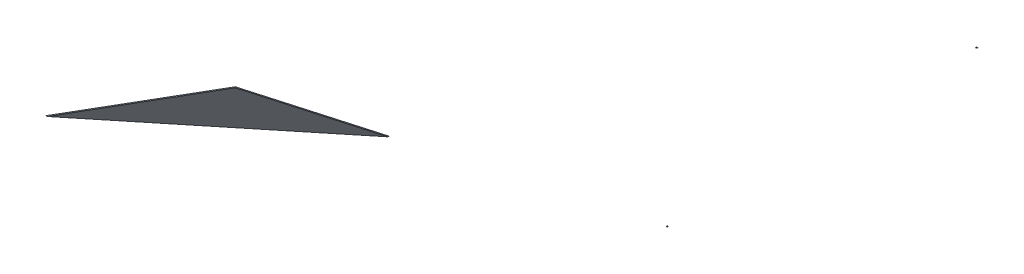
ISO-10303-21;
HEADER;
FILE_DESCRIPTION(('STEP AP214'),'2;1');
FILE_NAME('part.step','',(''),(''),'','','');
FILE_SCHEMA(('AUTOMOTIVE_DESIGN { 1 0 10303 214 1 1 1 1 }'));
ENDSEC;
DATA;
#1=APPLICATION_CONTEXT('core data for automotive mechanical design processes');
#2=APPLICATION_PROTOCOL_DEFINITION('international standard','automotive_design',2000,#1);
#3=PRODUCT_CONTEXT('',#1,'mechanical');
#4=PRODUCT('Part','Part','',(#3));
#5=PRODUCT_RELATED_PRODUCT_CATEGORY('part','',(#4));
#6=PRODUCT_DEFINITION_FORMATION('','',#4);
#7=PRODUCT_DEFINITION_CONTEXT('part definition',#1,'design');
#8=PRODUCT_DEFINITION('design','',#6,#7);
#9=PRODUCT_DEFINITION_SHAPE('','',#8);
#10=(LENGTH_UNIT() NAMED_UNIT(*) SI_UNIT(.MILLI.,.METRE.));
#11=(NAMED_UNIT(*) PLANE_ANGLE_UNIT() SI_UNIT($,.RADIAN.));
#12=(NAMED_UNIT(*) SI_UNIT($,.STERADIAN.) SOLID_ANGLE_UNIT());
#13=UNCERTAINTY_MEASURE_WITH_UNIT(LENGTH_MEASURE(1.E-05),#10,'distance_accuracy_value','');
#14=(GEOMETRIC_REPRESENTATION_CONTEXT(3) GLOBAL_UNCERTAINTY_ASSIGNED_CONTEXT((#13)) GLOBAL_UNIT_ASSIGNED_CONTEXT((#10,
#11,#12)) REPRESENTATION_CONTEXT('',''));
#15=CARTESIAN_POINT('',(0.,0.,0.));
#16=DIRECTION('',(0.,0.,1.));
#17=DIRECTION('',(1.,0.,0.));
#18=AXIS2_PLACEMENT_3D('',#15,#16,#17);
#19=CARTESIAN_POINT('',(1158.95080176923,2608.91710603682,1121.2545563695));
#20=DIRECTION('',(0.,-1.,0.));
#21=DIRECTION('',(0.,0.,-1.));
#22=AXIS2_PLACEMENT_3D('',#19,#20,#21);
#23=PLANE('',#22);
#24=DIRECTION('',(-1.,0.,0.));
#25=VECTOR('',#24,1.);
#26=CARTESIAN_POINT('',(1158.95080176923,2608.91710603682,1121.2545563695));
#27=LINE('',#26,#25);
#28=CARTESIAN_POINT('',(1158.95080176923,2608.91710603682,1121.2545563695));
#29=VERTEX_POINT('',#28);
#30=CARTESIAN_POINT('',(1155.77580176923,2608.91710603682,1121.2545563695));
#31=VERTEX_POINT('',#30);
#32=EDGE_CURVE('E77',#29,#31,#27,.T.);
#33=ORIENTED_EDGE('',*,*,#32,.T.);
#34=DIRECTION('',(0.,0.,1.));
#35=VECTOR('',#34,1.);
#36=CARTESIAN_POINT('',(1155.77580176923,2608.91710603682,1121.2545563695));
#37=LINE('',#36,#35);
#38=CARTESIAN_POINT('',(1155.77580176923,2608.91710603682,1123.8342438695));
#39=VERTEX_POINT('',#38);
#40=EDGE_CURVE('E71',#31,#39,#37,.T.);
#41=ORIENTED_EDGE('',*,*,#40,.T.);
#42=DIRECTION('',(-0.776114000116266,0.,0.630592625094465));
#43=VECTOR('',#42,1.);
#44=CARTESIAN_POINT('',(1158.95080176923,2608.91710603682,1121.2545563695));
#45=LINE('',#44,#43);
#46=EDGE_CURVE('E76',#29,#39,#45,.T.);
#47=ORIENTED_EDGE('',*,*,#46,.F.);
#48=EDGE_LOOP('',(#33,#41,#47));
#49=FACE_BOUND('',#48,.T.);
#50=ADVANCED_FACE('F48',(#49),#23,.F.);
#51=CARTESIAN_POINT('',(-316.337763001159,500.225965029596,-389.338785232194));
#52=DIRECTION('',(-0.446530337817959,0.70609992000595,-0.54957580039133));
#53=DIRECTION('',(0.,0.614210049001455,0.789142582620929));
#54=AXIS2_PLACEMENT_3D('',#51,#52,#53);
#55=PLANE('',#54);
#56=ORIENTED_EDGE('',*,*,#46,.T.);
#57=DIRECTION('',(0.,-0.614210049001455,-0.789142582620929));
#58=VECTOR('',#57,1.);
#59=CARTESIAN_POINT('',(1155.77580176923,1079.97105689285,-840.569360192474));
#60=LINE('',#59,#58);
#61=CARTESIAN_POINT('',(1155.77580176923,2606.90926864383,1121.2545563695));
#62=VERTEX_POINT('',#61);
#63=EDGE_CURVE('E64',#39,#62,#60,.T.);
#64=ORIENTED_EDGE('',*,*,#63,.T.);
#65=DIRECTION('',(0.84517937784663,0.53448275862069,0.));
#66=VECTOR('',#65,1.);
#67=CARTESIAN_POINT('',(-86.1674576744258,1821.51710603682,1121.2545563695));
#68=LINE('',#67,#66);
#69=EDGE_CURVE('E58',#62,#29,#68,.T.);
#70=ORIENTED_EDGE('',*,*,#69,.T.);
#71=EDGE_LOOP('',(#56,#64,#70));
#72=FACE_BOUND('',#71,.T.);
#73=ADVANCED_FACE('F94',(#72),#55,.F.);
#74=CARTESIAN_POINT('',(-86.1674576744258,1821.51710603682,1121.2545563695));
#75=DIRECTION('',(0.,0.,1.));
#76=DIRECTION('',(0.,-1.,0.));
#77=AXIS2_PLACEMENT_3D('',#74,#75,#76);
#78=PLANE('',#77);
#79=ORIENTED_EDGE('',*,*,#69,.F.);
#80=DIRECTION('',(0.,1.,0.));
#81=VECTOR('',#80,1.);
#82=CARTESIAN_POINT('',(1155.77580176923,1821.51710603682,1121.2545563695));
#83=LINE('',#82,#81);
#84=EDGE_CURVE('E13',#62,#31,#83,.T.);
#85=ORIENTED_EDGE('',*,*,#84,.T.);
#86=ORIENTED_EDGE('',*,*,#32,.F.);
#87=EDGE_LOOP('',(#79,#85,#86));
#88=FACE_BOUND('',#87,.T.);
#89=ADVANCED_FACE('F82',(#88),#78,.F.);
#90=CARTESIAN_POINT('',(1155.77580176923,0.,0.));
#91=DIRECTION('',(1.,0.,0.));
#92=DIRECTION('',(0.,0.,-1.));
#93=AXIS2_PLACEMENT_3D('',#90,#91,#92);
#94=PLANE('',#93);
#95=ORIENTED_EDGE('',*,*,#40,.F.);
#96=ORIENTED_EDGE('',*,*,#84,.F.);
#97=ORIENTED_EDGE('',*,*,#63,.F.);
#98=EDGE_LOOP('',(#95,#96,#97));
#99=FACE_BOUND('',#98,.T.);
#100=ADVANCED_FACE('F50',(#99),#94,.F.);
#101=CLOSED_SHELL('',(#50,#73,#89,#100));
#102=MANIFOLD_SOLID_BREP('B2',#101);
#103=CARTESIAN_POINT('',(-86.1674576744258,1821.51710603682,1781.65455636951));
#104=DIRECTION('',(0.,0.,1.));
#105=DIRECTION('',(0.,-1.,0.));
#106=AXIS2_PLACEMENT_3D('',#103,#104,#105);
#107=PLANE('',#106);
#108=DIRECTION('',(0.,1.,0.));
#109=VECTOR('',#108,1.);
#110=CARTESIAN_POINT('',(1155.77580176923,1821.51710603682,1781.65455636951));
#111=LINE('',#110,#109);
#112=CARTESIAN_POINT('',(1155.77580176923,2606.90926864383,1781.6545563695));
#113=VERTEX_POINT('',#112);
#114=CARTESIAN_POINT('',(1155.77580176923,2608.91710603682,1781.6545563695));
#115=VERTEX_POINT('',#114);
#116=EDGE_CURVE('E46',#113,#115,#111,.T.);
#117=ORIENTED_EDGE('',*,*,#116,.F.);
#118=DIRECTION('',(0.84517937784663,0.53448275862069,0.));
#119=VECTOR('',#118,1.);
#120=CARTESIAN_POINT('',(-86.1674576744258,1821.51710603682,1781.65455636951));
#121=LINE('',#120,#119);
#122=CARTESIAN_POINT('',(1158.95080176923,2608.91710603682,1781.6545563695));
#123=VERTEX_POINT('',#122);
#124=EDGE_CURVE('E173',#113,#123,#121,.T.);
#125=ORIENTED_EDGE('',*,*,#124,.T.);
#126=DIRECTION('',(-1.,0.,0.));
#127=VECTOR('',#126,1.);
#128=CARTESIAN_POINT('',(1158.95080176923,2608.91710603682,1781.6545563695));
#129=LINE('',#128,#127);
#130=EDGE_CURVE('E170',#123,#115,#129,.T.);
#131=ORIENTED_EDGE('',*,*,#130,.T.);
#132=EDGE_LOOP('',(#117,#125,#131));
#133=FACE_BOUND('',#132,.T.);
#134=ADVANCED_FACE('F142',(#133),#107,.T.);
#135=CARTESIAN_POINT('',(-1028.71824250003,1626.71560523187,1266.11476000002));
#136=DIRECTION('',(-0.446530337817959,0.706099920005952,0.549575800391326));
#137=DIRECTION('',(0.,-0.614210049001451,0.789142582620932));
#138=AXIS2_PLACEMENT_3D('',#135,#136,#137);
#139=PLANE('',#138);
#140=ORIENTED_EDGE('',*,*,#124,.F.);
#141=DIRECTION('',(0.,0.614210049001451,-0.789142582620932));
#142=VECTOR('',#141,1.);
#143=CARTESIAN_POINT('',(1155.77580176923,2487.00908440184,1935.70338901769));
#144=LINE('',#143,#142);
#145=CARTESIAN_POINT('',(1155.77580176923,2608.91710603682,1779.07486886951));
#146=VERTEX_POINT('',#145);
#147=EDGE_CURVE('E146',#113,#146,#144,.T.);
#148=ORIENTED_EDGE('',*,*,#147,.T.);
#149=DIRECTION('',(-0.776114000116266,0.,-0.630592625094465));
#150=VECTOR('',#149,1.);
#151=CARTESIAN_POINT('',(1158.95080176923,2608.91710603682,1781.6545563695));
#152=LINE('',#151,#150);
#153=EDGE_CURVE('E169',#123,#146,#152,.T.);
#154=ORIENTED_EDGE('',*,*,#153,.F.);
#155=EDGE_LOOP('',(#140,#148,#154));
#156=FACE_BOUND('',#155,.T.);
#157=ADVANCED_FACE('F175',(#156),#139,.F.);
#158=CARTESIAN_POINT('',(1158.95080176923,2608.91710603682,1121.2545563695));
#159=DIRECTION('',(0.,-1.,0.));
#160=DIRECTION('',(0.,0.,-1.));
#161=AXIS2_PLACEMENT_3D('',#158,#159,#160);
#162=PLANE('',#161);
#163=ORIENTED_EDGE('',*,*,#153,.T.);
#164=DIRECTION('',(0.,0.,1.));
#165=VECTOR('',#164,1.);
#166=CARTESIAN_POINT('',(1155.77580176923,2608.91710603682,1121.2545563695));
#167=LINE('',#166,#165);
#168=EDGE_CURVE('E152',#146,#115,#167,.T.);
#169=ORIENTED_EDGE('',*,*,#168,.T.);
#170=ORIENTED_EDGE('',*,*,#130,.F.);
#171=EDGE_LOOP('',(#163,#169,#170));
#172=FACE_BOUND('',#171,.T.);
#173=ADVANCED_FACE('F189',(#172),#162,.F.);
#174=CARTESIAN_POINT('',(1155.77580176923,0.,0.));
#175=DIRECTION('',(1.,0.,0.));
#176=DIRECTION('',(0.,0.,-1.));
#177=AXIS2_PLACEMENT_3D('',#174,#175,#176);
#178=PLANE('',#177);
#179=ORIENTED_EDGE('',*,*,#147,.F.);
#180=ORIENTED_EDGE('',*,*,#116,.T.);
#181=ORIENTED_EDGE('',*,*,#168,.F.);
#182=EDGE_LOOP('',(#179,#180,#181));
#183=FACE_BOUND('',#182,.T.);
#184=ADVANCED_FACE('F144',(#183),#178,.F.);
#185=CLOSED_SHELL('',(#134,#157,#173,#184));
#186=MANIFOLD_SOLID_BREP('B7',#185);
#187=CARTESIAN_POINT('',(-86.1674576744258,1821.51710603682,1121.2545563695));
#188=DIRECTION('',(0.,1.,0.));
#189=DIRECTION('',(0.,0.,1.));
#190=AXIS2_PLACEMENT_3D('',#187,#188,#189);
#191=PLANE('',#190);
#192=DIRECTION('',(0.776114000116265,0.,-0.630592625094466));
#193=VECTOR('',#192,1.);
#194=CARTESIAN_POINT('',(-86.1674576744258,1821.51710603682,1121.2545563695));
#195=LINE('',#194,#193);
#196=CARTESIAN_POINT('',(-492.558178656549,1821.51710603682,1451.44701716748));
#197=VERTEX_POINT('',#196);
#198=CARTESIAN_POINT('',(-92.634198230768,1821.51710603682,1126.50878307153));
#199=VERTEX_POINT('',#198);
#200=EDGE_CURVE('E231',#197,#199,#195,.T.);
#201=ORIENTED_EDGE('',*,*,#200,.F.);
#202=DIRECTION('',(-1.,0.,0.));
#203=VECTOR('',#202,1.);
#204=CARTESIAN_POINT('',(-86.1674576744258,1821.51710603682,1451.44701716748));
#205=LINE('',#204,#203);
#206=CARTESIAN_POINT('',(-495.73317865655,1821.51710603682,1451.44701716748));
#207=VERTEX_POINT('',#206);
#208=EDGE_CURVE('E282',#197,#207,#205,.T.);
#209=ORIENTED_EDGE('',*,*,#208,.T.);
#210=DIRECTION('',(0.776114000116265,0.,-0.630592625094466));
#211=VECTOR('',#210,1.);
#212=CARTESIAN_POINT('',(-89.3424576744258,1821.51710603682,1121.2545563695));
#213=LINE('',#212,#211);
#214=CARTESIAN_POINT('',(-92.6341982307692,1821.51710603682,1123.92909557153));
#215=VERTEX_POINT('',#214);
#216=EDGE_CURVE('E251',#207,#215,#213,.T.);
#217=ORIENTED_EDGE('',*,*,#216,.T.);
#218=DIRECTION('',(0.,0.,-1.));
#219=VECTOR('',#218,1.);
#220=CARTESIAN_POINT('',(-92.6341982307692,1821.51710603682,1121.2545563695));
#221=LINE('',#220,#219);
#222=EDGE_CURVE('E274',#199,#215,#221,.T.);
#223=ORIENTED_EDGE('',*,*,#222,.F.);
#224=EDGE_LOOP('',(#201,#209,#217,#223));
#225=FACE_BOUND('',#224,.T.);
#226=ADVANCED_FACE('F227',(#225),#191,.F.);
#227=CARTESIAN_POINT('',(-316.337763001159,500.225965029596,-389.338785232194));
#228=DIRECTION('',(-0.446530337817959,0.70609992000595,-0.54957580039133));
#229=DIRECTION('',(0.,0.614210049001455,0.789142582620929));
#230=AXIS2_PLACEMENT_3D('',#227,#228,#229);
#231=PLANE('',#230);
#232=DIRECTION('',(0.,-0.614210049001455,-0.789142582620929));
#233=VECTOR('',#232,1.);
#234=CARTESIAN_POINT('',(-92.6341982307692,588.324496835582,-457.908147384462));
#235=LINE('',#234,#233);
#236=CARTESIAN_POINT('',(-92.6341982307692,2074.42492406847,1451.44701716748));
#237=VERTEX_POINT('',#236);
#238=EDGE_CURVE('E276',#237,#199,#235,.T.);
#239=ORIENTED_EDGE('',*,*,#238,.F.);
#240=DIRECTION('',(-0.845179377846631,-0.534482758620689,0.));
#241=VECTOR('',#240,1.);
#242=CARTESIAN_POINT('',(-963.550844902218,1523.66618096281,1451.44701716748));
#243=LINE('',#242,#241);
#244=EDGE_CURVE('E243',#237,#197,#243,.T.);
#245=ORIENTED_EDGE('',*,*,#244,.T.);
#246=ORIENTED_EDGE('',*,*,#200,.T.);
#247=EDGE_LOOP('',(#239,#245,#246));
#248=FACE_BOUND('',#247,.T.);
#249=ADVANCED_FACE('F287',(#248),#231,.F.);
#250=CARTESIAN_POINT('',(-319.512763001159,500.225965029596,-389.338785232194));
#251=DIRECTION('',(-0.446530337817959,0.70609992000595,-0.54957580039133));
#252=DIRECTION('',(0.,0.614210049001455,0.789142582620929));
#253=AXIS2_PLACEMENT_3D('',#250,#251,#252);
#254=PLANE('',#253);
#255=DIRECTION('',(-0.845179377846631,-0.534482758620689,0.));
#256=VECTOR('',#255,1.);
#257=CARTESIAN_POINT('',(-966.725844902218,1523.66618096281,1451.44701716748));
#258=LINE('',#257,#256);
#259=CARTESIAN_POINT('',(-92.6341982307692,2076.43276146146,1451.44701716748));
#260=VERTEX_POINT('',#259);
#261=EDGE_CURVE('E264',#260,#207,#258,.T.);
#262=ORIENTED_EDGE('',*,*,#261,.F.);
#263=DIRECTION('',(0.,-0.614210049001455,-0.789142582620929));
#264=VECTOR('',#263,1.);
#265=CARTESIAN_POINT('',(-92.6341982307692,589.574869572248,-458.881344772071));
#266=LINE('',#265,#264);
#267=EDGE_CURVE('E270',#260,#215,#266,.T.);
#268=ORIENTED_EDGE('',*,*,#267,.T.);
#269=ORIENTED_EDGE('',*,*,#216,.F.);
#270=EDGE_LOOP('',(#262,#268,#269));
#271=FACE_BOUND('',#270,.T.);
#272=ADVANCED_FACE('F229',(#271),#254,.T.);
#273=CARTESIAN_POINT('',(-92.6341982307692,0.,0.));
#274=DIRECTION('',(1.,0.,0.));
#275=DIRECTION('',(0.,0.,-1.));
#276=AXIS2_PLACEMENT_3D('',#273,#274,#275);
#277=PLANE('',#276);
#278=DIRECTION('',(0.,1.,0.));
#279=VECTOR('',#278,1.);
#280=CARTESIAN_POINT('',(-92.6341982307692,0.,1451.44701716748));
#281=LINE('',#280,#279);
#282=EDGE_CURVE('E140',#237,#260,#281,.T.);
#283=ORIENTED_EDGE('',*,*,#282,.F.);
#284=ORIENTED_EDGE('',*,*,#238,.T.);
#285=ORIENTED_EDGE('',*,*,#222,.T.);
#286=ORIENTED_EDGE('',*,*,#267,.F.);
#287=EDGE_LOOP('',(#283,#284,#285,#286));
#288=FACE_BOUND('',#287,.T.);
#289=ADVANCED_FACE('F273',(#288),#277,.T.);
#290=CARTESIAN_POINT('',(0.,0.,1451.44701716748));
#291=DIRECTION('',(0.,0.,-1.));
#292=DIRECTION('',(-1.,0.,0.));
#293=AXIS2_PLACEMENT_3D('',#290,#291,#292);
#294=PLANE('',#293);
#295=ORIENTED_EDGE('',*,*,#244,.F.);
#296=ORIENTED_EDGE('',*,*,#282,.T.);
#297=ORIENTED_EDGE('',*,*,#261,.T.);
#298=ORIENTED_EDGE('',*,*,#208,.F.);
#299=EDGE_LOOP('',(#295,#296,#297,#298));
#300=FACE_BOUND('',#299,.T.);
#301=ADVANCED_FACE('F263',(#300),#294,.F.);
#302=CLOSED_SHELL('',(#226,#249,#272,#289,#301));
#303=MANIFOLD_SOLID_BREP('B40',#302);
#304=ADVANCED_BREP_SHAPE_REPRESENTATION('',(#18,#102,#186,#303),#14);
#305=SHAPE_DEFINITION_REPRESENTATION(#9,#304);
ENDSEC;
END-ISO-10303-21;
